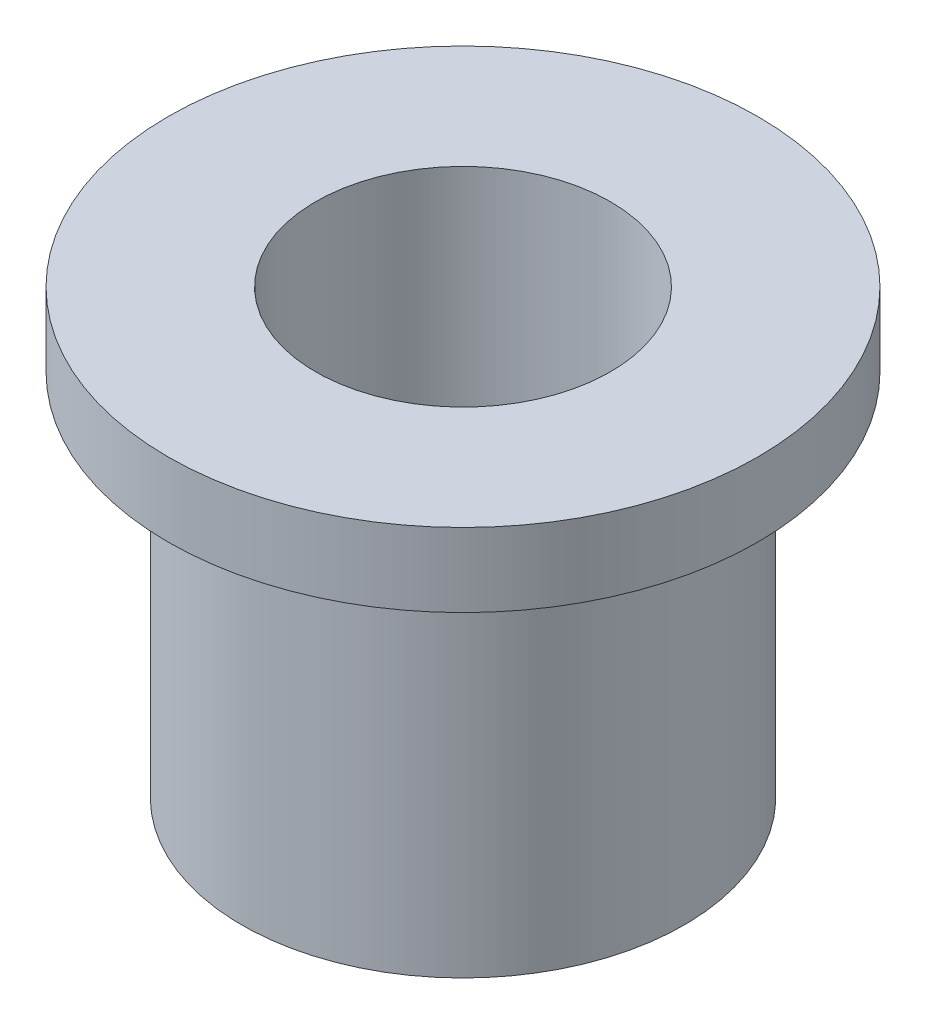
ISO-10303-21;
HEADER;
FILE_DESCRIPTION(('STEP AP214'),'2;1');
FILE_NAME('part.step','',(''),(''),'','','');
FILE_SCHEMA(('AUTOMOTIVE_DESIGN { 1 0 10303 214 1 1 1 1 }'));
ENDSEC;
DATA;
#1=APPLICATION_CONTEXT('core data for automotive mechanical design processes');
#2=APPLICATION_PROTOCOL_DEFINITION('international standard','automotive_design',2000,#1);
#3=PRODUCT_CONTEXT('',#1,'mechanical');
#4=PRODUCT('Part','Part','',(#3));
#5=PRODUCT_RELATED_PRODUCT_CATEGORY('part','',(#4));
#6=PRODUCT_DEFINITION_FORMATION('','',#4);
#7=PRODUCT_DEFINITION_CONTEXT('part definition',#1,'design');
#8=PRODUCT_DEFINITION('design','',#6,#7);
#9=PRODUCT_DEFINITION_SHAPE('','',#8);
#10=(LENGTH_UNIT() NAMED_UNIT(*) SI_UNIT(.MILLI.,.METRE.));
#11=(NAMED_UNIT(*) PLANE_ANGLE_UNIT() SI_UNIT($,.RADIAN.));
#12=(NAMED_UNIT(*) SI_UNIT($,.STERADIAN.) SOLID_ANGLE_UNIT());
#13=UNCERTAINTY_MEASURE_WITH_UNIT(LENGTH_MEASURE(1.E-05),#10,'distance_accuracy_value','');
#14=(GEOMETRIC_REPRESENTATION_CONTEXT(3) GLOBAL_UNCERTAINTY_ASSIGNED_CONTEXT((#13)) GLOBAL_UNIT_ASSIGNED_CONTEXT((#10,
#11,#12)) REPRESENTATION_CONTEXT('',''));
#15=CARTESIAN_POINT('',(0.,0.,0.));
#16=DIRECTION('',(0.,0.,1.));
#17=DIRECTION('',(1.,0.,0.));
#18=AXIS2_PLACEMENT_3D('',#15,#16,#17);
#19=CARTESIAN_POINT('',(6.00000000000001,8.5,0.));
#20=DIRECTION('',(0.,-1.,0.));
#21=DIRECTION('',(0.,0.,-1.));
#22=AXIS2_PLACEMENT_3D('',#19,#20,#21);
#23=PLANE('',#22);
#24=CARTESIAN_POINT('',(0.,8.5,0.));
#25=DIRECTION('',(0.,-1.,0.));
#26=DIRECTION('',(0.,0.,-1.));
#27=AXIS2_PLACEMENT_3D('',#24,#25,#26);
#28=CIRCLE('',#27,6.00000000000001);
#29=CARTESIAN_POINT('',(0.,8.5,-6.00000000000001));
#30=VERTEX_POINT('',#29);
#31=EDGE_CURVE('E59',#30,#30,#28,.T.);
#32=ORIENTED_EDGE('',*,*,#31,.T.);
#33=EDGE_LOOP('',(#32));
#34=FACE_BOUND('',#33,.T.);
#35=CARTESIAN_POINT('',(0.,8.5,0.));
#36=DIRECTION('',(0.,-1.,0.));
#37=DIRECTION('',(0.,0.,-1.));
#38=AXIS2_PLACEMENT_3D('',#35,#36,#37);
#39=CIRCLE('',#38,4.);
#40=CARTESIAN_POINT('',(0.,8.5,-4.));
#41=VERTEX_POINT('',#40);
#42=EDGE_CURVE('E10',#41,#41,#39,.T.);
#43=ORIENTED_EDGE('',*,*,#42,.F.);
#44=EDGE_LOOP('',(#43));
#45=FACE_BOUND('',#44,.T.);
#46=ADVANCED_FACE('F37',(#34,#45),#23,.T.);
#47=CARTESIAN_POINT('',(0.,0.,0.));
#48=DIRECTION('',(0.,-1.,0.));
#49=DIRECTION('',(0.,0.,-1.));
#50=AXIS2_PLACEMENT_3D('',#47,#48,#49);
#51=CYLINDRICAL_SURFACE('',#50,4.);
#52=ORIENTED_EDGE('',*,*,#42,.T.);
#53=EDGE_LOOP('',(#52));
#54=FACE_BOUND('',#53,.T.);
#55=CARTESIAN_POINT('',(0.,20.5,0.));
#56=DIRECTION('',(0.,-1.,0.));
#57=DIRECTION('',(0.,0.,-1.));
#58=AXIS2_PLACEMENT_3D('',#55,#56,#57);
#59=CIRCLE('',#58,4.);
#60=CARTESIAN_POINT('',(0.,20.5,-4.));
#61=VERTEX_POINT('',#60);
#62=EDGE_CURVE('E43',#61,#61,#59,.T.);
#63=ORIENTED_EDGE('',*,*,#62,.F.);
#64=EDGE_LOOP('',(#63));
#65=FACE_BOUND('',#64,.T.);
#66=ADVANCED_FACE('F77',(#54,#65),#51,.F.);
#67=CARTESIAN_POINT('',(4.,20.5,0.));
#68=DIRECTION('',(0.,1.,0.));
#69=DIRECTION('',(0.,0.,1.));
#70=AXIS2_PLACEMENT_3D('',#67,#68,#69);
#71=PLANE('',#70);
#72=ORIENTED_EDGE('',*,*,#62,.T.);
#73=EDGE_LOOP('',(#72));
#74=FACE_BOUND('',#73,.T.);
#75=CARTESIAN_POINT('',(0.,20.5,0.));
#76=DIRECTION('',(0.,-1.,0.));
#77=DIRECTION('',(0.,0.,-1.));
#78=AXIS2_PLACEMENT_3D('',#75,#76,#77);
#79=CIRCLE('',#78,8.);
#80=CARTESIAN_POINT('',(0.,20.5,-8.));
#81=VERTEX_POINT('',#80);
#82=EDGE_CURVE('E47',#81,#81,#79,.T.);
#83=ORIENTED_EDGE('',*,*,#82,.F.);
#84=EDGE_LOOP('',(#83));
#85=FACE_BOUND('',#84,.T.);
#86=ADVANCED_FACE('F81',(#74,#85),#71,.T.);
#87=CARTESIAN_POINT('',(0.,0.,0.));
#88=DIRECTION('',(0.,-1.,0.));
#89=DIRECTION('',(0.,0.,-1.));
#90=AXIS2_PLACEMENT_3D('',#87,#88,#89);
#91=CYLINDRICAL_SURFACE('',#90,8.);
#92=ORIENTED_EDGE('',*,*,#82,.T.);
#93=EDGE_LOOP('',(#92));
#94=FACE_BOUND('',#93,.T.);
#95=CARTESIAN_POINT('',(0.,18.5,0.));
#96=DIRECTION('',(0.,-1.,0.));
#97=DIRECTION('',(0.,0.,-1.));
#98=AXIS2_PLACEMENT_3D('',#95,#96,#97);
#99=CIRCLE('',#98,8.);
#100=CARTESIAN_POINT('',(0.,18.5,-8.));
#101=VERTEX_POINT('',#100);
#102=EDGE_CURVE('E51',#101,#101,#99,.T.);
#103=ORIENTED_EDGE('',*,*,#102,.F.);
#104=EDGE_LOOP('',(#103));
#105=FACE_BOUND('',#104,.T.);
#106=ADVANCED_FACE('F73',(#94,#105),#91,.T.);
#107=CARTESIAN_POINT('',(8.,18.5,0.));
#108=DIRECTION('',(0.,-1.,0.));
#109=DIRECTION('',(0.,0.,-1.));
#110=AXIS2_PLACEMENT_3D('',#107,#108,#109);
#111=PLANE('',#110);
#112=ORIENTED_EDGE('',*,*,#102,.T.);
#113=EDGE_LOOP('',(#112));
#114=FACE_BOUND('',#113,.T.);
#115=CARTESIAN_POINT('',(0.,18.5,0.));
#116=DIRECTION('',(0.,-1.,0.));
#117=DIRECTION('',(0.,0.,-1.));
#118=AXIS2_PLACEMENT_3D('',#115,#116,#117);
#119=CIRCLE('',#118,6.00000000000001);
#120=CARTESIAN_POINT('',(0.,18.5,-6.00000000000001));
#121=VERTEX_POINT('',#120);
#122=EDGE_CURVE('E56',#121,#121,#119,.T.);
#123=ORIENTED_EDGE('',*,*,#122,.F.);
#124=EDGE_LOOP('',(#123));
#125=FACE_BOUND('',#124,.T.);
#126=ADVANCED_FACE('F67',(#114,#125),#111,.T.);
#127=CARTESIAN_POINT('',(0.,0.,0.));
#128=DIRECTION('',(0.,-1.,0.));
#129=DIRECTION('',(0.,0.,-1.));
#130=AXIS2_PLACEMENT_3D('',#127,#128,#129);
#131=CYLINDRICAL_SURFACE('',#130,6.00000000000001);
#132=ORIENTED_EDGE('',*,*,#122,.T.);
#133=EDGE_LOOP('',(#132));
#134=FACE_BOUND('',#133,.T.);
#135=ORIENTED_EDGE('',*,*,#31,.F.);
#136=EDGE_LOOP('',(#135));
#137=FACE_BOUND('',#136,.T.);
#138=ADVANCED_FACE('F65',(#134,#137),#131,.T.);
#139=CLOSED_SHELL('',(#46,#66,#86,#106,#126,#138));
#140=MANIFOLD_SOLID_BREP('B2',#139);
#141=ADVANCED_BREP_SHAPE_REPRESENTATION('',(#18,#140),#14);
#142=SHAPE_DEFINITION_REPRESENTATION(#9,#141);
ENDSEC;
END-ISO-10303-21;
